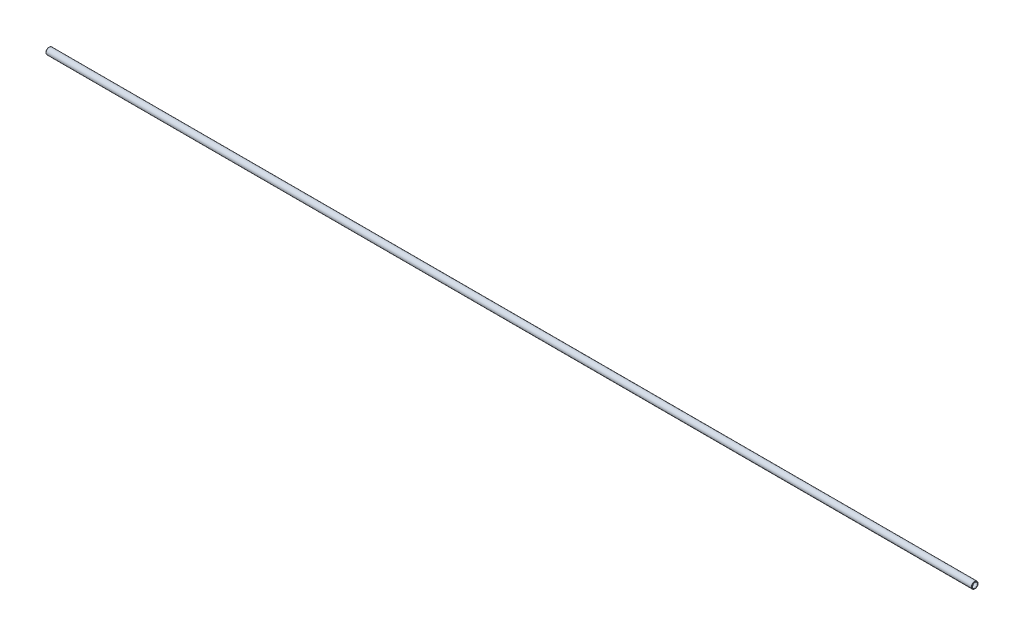
ISO-10303-21;
HEADER;
FILE_DESCRIPTION(('STEP AP214'),'2;1');
FILE_NAME('part.step','',(''),(''),'','','');
FILE_SCHEMA(('AUTOMOTIVE_DESIGN { 1 0 10303 214 1 1 1 1 }'));
ENDSEC;
DATA;
#1=APPLICATION_CONTEXT('core data for automotive mechanical design processes');
#2=APPLICATION_PROTOCOL_DEFINITION('international standard','automotive_design',2000,#1);
#3=PRODUCT_CONTEXT('',#1,'mechanical');
#4=PRODUCT('Part','Part','',(#3));
#5=PRODUCT_RELATED_PRODUCT_CATEGORY('part','',(#4));
#6=PRODUCT_DEFINITION_FORMATION('','',#4);
#7=PRODUCT_DEFINITION_CONTEXT('part definition',#1,'design');
#8=PRODUCT_DEFINITION('design','',#6,#7);
#9=PRODUCT_DEFINITION_SHAPE('','',#8);
#10=(LENGTH_UNIT() NAMED_UNIT(*) SI_UNIT(.MILLI.,.METRE.));
#11=(NAMED_UNIT(*) PLANE_ANGLE_UNIT() SI_UNIT($,.RADIAN.));
#12=(NAMED_UNIT(*) SI_UNIT($,.STERADIAN.) SOLID_ANGLE_UNIT());
#13=UNCERTAINTY_MEASURE_WITH_UNIT(LENGTH_MEASURE(1.E-05),#10,'distance_accuracy_value','');
#14=(GEOMETRIC_REPRESENTATION_CONTEXT(3) GLOBAL_UNCERTAINTY_ASSIGNED_CONTEXT((#13)) GLOBAL_UNIT_ASSIGNED_CONTEXT((#10,
#11,#12)) REPRESENTATION_CONTEXT('',''));
#15=CARTESIAN_POINT('',(0.,0.,0.));
#16=DIRECTION('',(0.,0.,1.));
#17=DIRECTION('',(1.,0.,0.));
#18=AXIS2_PLACEMENT_3D('',#15,#16,#17);
#19=CARTESIAN_POINT('',(-0.355226146905763,0.,0.));
#20=DIRECTION('',(-1.,0.,0.));
#21=DIRECTION('',(0.,0.,1.));
#22=AXIS2_PLACEMENT_3D('',#19,#20,#21);
#23=TOROIDAL_SURFACE('',#22,3.77968126932705,0.126999999999896);
#24=CARTESIAN_POINT('',(-0.445028708116357,0.,0.));
#25=DIRECTION('',(-1.,0.,0.));
#26=DIRECTION('',(0.,0.,1.));
#27=AXIS2_PLACEMENT_3D('',#24,#25,#26);
#28=CIRCLE('',#27,3.6898787081164);
#29=CARTESIAN_POINT('',(-0.445028708116357,0.,3.6898787081164));
#30=VERTEX_POINT('',#29);
#31=EDGE_CURVE('E10',#30,#30,#28,.T.);
#32=ORIENTED_EDGE('',*,*,#31,.F.);
#33=EDGE_LOOP('',(#32));
#34=FACE_BOUND('',#33,.T.);
#35=CARTESIAN_POINT('',(-0.445028708116357,0.,0.));
#36=DIRECTION('',(-1.,0.,0.));
#37=DIRECTION('',(0.,0.,1.));
#38=AXIS2_PLACEMENT_3D('',#35,#36,#37);
#39=CIRCLE('',#38,3.8694838305377);
#40=CARTESIAN_POINT('',(-0.445028708116357,0.,3.8694838305377));
#41=VERTEX_POINT('',#40);
#42=EDGE_CURVE('E78',#41,#41,#39,.T.);
#43=ORIENTED_EDGE('',*,*,#42,.T.);
#44=EDGE_LOOP('',(#43));
#45=FACE_BOUND('',#44,.T.);
#46=ADVANCED_FACE('F32',(#34,#45),#23,.T.);
#47=CARTESIAN_POINT('',(-0.445028708116357,0.,0.));
#48=DIRECTION('',(-1.,0.,0.));
#49=DIRECTION('',(0.,0.,1.));
#50=AXIS2_PLACEMENT_3D('',#47,#48,#49);
#51=CONICAL_SURFACE('',#50,3.6898787081164,0.785398163397365);
#52=CARTESIAN_POINT('',(-0.27939999999993,0.,0.));
#53=DIRECTION('',(-1.,0.,0.));
#54=DIRECTION('',(0.,0.,1.));
#55=AXIS2_PLACEMENT_3D('',#52,#53,#54);
#56=CIRCLE('',#55,3.52425);
#57=CARTESIAN_POINT('',(-0.27939999999993,0.,3.52425));
#58=VERTEX_POINT('',#57);
#59=EDGE_CURVE('E38',#58,#58,#56,.T.);
#60=ORIENTED_EDGE('',*,*,#59,.F.);
#61=EDGE_LOOP('',(#60));
#62=FACE_BOUND('',#61,.T.);
#63=ORIENTED_EDGE('',*,*,#31,.T.);
#64=EDGE_LOOP('',(#63));
#65=FACE_BOUND('',#64,.T.);
#66=ADVANCED_FACE('F151',(#62,#65),#51,.F.);
#67=CARTESIAN_POINT('',(1288.7706,0.,0.));
#68=DIRECTION('',(-1.,0.,0.));
#69=DIRECTION('',(0.,0.,1.));
#70=AXIS2_PLACEMENT_3D('',#67,#68,#69);
#71=CYLINDRICAL_SURFACE('',#70,3.52425);
#72=CARTESIAN_POINT('',(0.,0.,0.));
#73=DIRECTION('',(-1.,0.,0.));
#74=DIRECTION('',(0.,0.,1.));
#75=AXIS2_PLACEMENT_3D('',#72,#73,#74);
#76=CIRCLE('',#75,3.52425);
#77=CARTESIAN_POINT('',(0.,0.,3.52425));
#78=VERTEX_POINT('',#77);
#79=EDGE_CURVE('E42',#78,#78,#76,.T.);
#80=ORIENTED_EDGE('',*,*,#79,.F.);
#81=EDGE_LOOP('',(#80));
#82=FACE_BOUND('',#81,.T.);
#83=ORIENTED_EDGE('',*,*,#59,.T.);
#84=EDGE_LOOP('',(#83));
#85=FACE_BOUND('',#84,.T.);
#86=ADVANCED_FACE('F146',(#82,#85),#71,.F.);
#87=CARTESIAN_POINT('',(0.,0.,0.));
#88=DIRECTION('',(1.,0.,0.));
#89=DIRECTION('',(0.,0.,-1.));
#90=AXIS2_PLACEMENT_3D('',#87,#88,#89);
#91=CONICAL_SURFACE('',#90,3.52425,0.785398163397376);
#92=CARTESIAN_POINT('',(0.558800000000081,0.,0.));
#93=DIRECTION('',(-1.,0.,0.));
#94=DIRECTION('',(0.,0.,1.));
#95=AXIS2_PLACEMENT_3D('',#92,#93,#94);
#96=CIRCLE('',#95,4.08305);
#97=CARTESIAN_POINT('',(0.558800000000081,0.,4.08305));
#98=VERTEX_POINT('',#97);
#99=EDGE_CURVE('E46',#98,#98,#96,.T.);
#100=ORIENTED_EDGE('',*,*,#99,.F.);
#101=EDGE_LOOP('',(#100));
#102=FACE_BOUND('',#101,.T.);
#103=ORIENTED_EDGE('',*,*,#79,.T.);
#104=EDGE_LOOP('',(#103));
#105=FACE_BOUND('',#104,.T.);
#106=ADVANCED_FACE('F140',(#102,#105),#91,.F.);
#107=CARTESIAN_POINT('',(1288.7706,0.,0.));
#108=DIRECTION('',(-1.,0.,0.));
#109=DIRECTION('',(0.,0.,1.));
#110=AXIS2_PLACEMENT_3D('',#107,#108,#109);
#111=CYLINDRICAL_SURFACE('',#110,4.08305);
#112=CARTESIAN_POINT('',(1288.2118,0.,0.));
#113=DIRECTION('',(-1.,0.,0.));
#114=DIRECTION('',(0.,0.,1.));
#115=AXIS2_PLACEMENT_3D('',#112,#113,#114);
#116=CIRCLE('',#115,4.08305);
#117=CARTESIAN_POINT('',(1288.2118,0.,4.08305));
#118=VERTEX_POINT('',#117);
#119=EDGE_CURVE('E51',#118,#118,#116,.T.);
#120=ORIENTED_EDGE('',*,*,#119,.F.);
#121=EDGE_LOOP('',(#120));
#122=FACE_BOUND('',#121,.T.);
#123=ORIENTED_EDGE('',*,*,#99,.T.);
#124=EDGE_LOOP('',(#123));
#125=FACE_BOUND('',#124,.T.);
#126=ADVANCED_FACE('F134',(#122,#125),#111,.F.);
#127=CARTESIAN_POINT('',(1288.2118,0.,0.));
#128=DIRECTION('',(-1.,0.,0.));
#129=DIRECTION('',(0.,0.,1.));
#130=AXIS2_PLACEMENT_3D('',#127,#128,#129);
#131=CONICAL_SURFACE('',#130,4.08305,0.785398163397376);
#132=CARTESIAN_POINT('',(1288.7706,0.,0.));
#133=DIRECTION('',(-1.,0.,0.));
#134=DIRECTION('',(0.,0.,1.));
#135=AXIS2_PLACEMENT_3D('',#132,#133,#134);
#136=CIRCLE('',#135,3.52425);
#137=CARTESIAN_POINT('',(1288.7706,0.,3.52425));
#138=VERTEX_POINT('',#137);
#139=EDGE_CURVE('E54',#138,#138,#136,.T.);
#140=ORIENTED_EDGE('',*,*,#139,.F.);
#141=EDGE_LOOP('',(#140));
#142=FACE_BOUND('',#141,.T.);
#143=ORIENTED_EDGE('',*,*,#119,.T.);
#144=EDGE_LOOP('',(#143));
#145=FACE_BOUND('',#144,.T.);
#146=ADVANCED_FACE('F128',(#142,#145),#131,.F.);
#147=CARTESIAN_POINT('',(1288.7706,0.,0.));
#148=DIRECTION('',(-1.,0.,0.));
#149=DIRECTION('',(0.,0.,1.));
#150=AXIS2_PLACEMENT_3D('',#147,#148,#149);
#151=CYLINDRICAL_SURFACE('',#150,3.52425);
#152=CARTESIAN_POINT('',(1289.05,0.,0.));
#153=DIRECTION('',(-1.,0.,0.));
#154=DIRECTION('',(0.,0.,1.));
#155=AXIS2_PLACEMENT_3D('',#152,#153,#154);
#156=CIRCLE('',#155,3.52425);
#157=CARTESIAN_POINT('',(1289.05,0.,3.52425));
#158=VERTEX_POINT('',#157);
#159=EDGE_CURVE('E57',#158,#158,#156,.T.);
#160=ORIENTED_EDGE('',*,*,#159,.F.);
#161=EDGE_LOOP('',(#160));
#162=FACE_BOUND('',#161,.T.);
#163=ORIENTED_EDGE('',*,*,#139,.T.);
#164=EDGE_LOOP('',(#163));
#165=FACE_BOUND('',#164,.T.);
#166=ADVANCED_FACE('F122',(#162,#165),#151,.F.);
#167=CARTESIAN_POINT('',(1289.05,0.,0.));
#168=DIRECTION('',(1.,0.,0.));
#169=DIRECTION('',(0.,0.,-1.));
#170=AXIS2_PLACEMENT_3D('',#167,#168,#169);
#171=CONICAL_SURFACE('',#170,3.52425,0.785398163438399);
#172=CARTESIAN_POINT('',(1289.21562870811,0.,0.));
#173=DIRECTION('',(-1.,0.,0.));
#174=DIRECTION('',(0.,0.,1.));
#175=AXIS2_PLACEMENT_3D('',#172,#173,#174);
#176=CIRCLE('',#175,3.68987870812777);
#177=CARTESIAN_POINT('',(1289.21562870811,0.,3.68987870812777));
#178=VERTEX_POINT('',#177);
#179=EDGE_CURVE('E60',#178,#178,#176,.T.);
#180=ORIENTED_EDGE('',*,*,#179,.F.);
#181=EDGE_LOOP('',(#180));
#182=FACE_BOUND('',#181,.T.);
#183=ORIENTED_EDGE('',*,*,#159,.T.);
#184=EDGE_LOOP('',(#183));
#185=FACE_BOUND('',#184,.T.);
#186=ADVANCED_FACE('F116',(#182,#185),#171,.F.);
#187=CARTESIAN_POINT('',(1289.12582614693,0.,0.));
#188=DIRECTION('',(-1.,0.,0.));
#189=DIRECTION('',(0.,0.,1.));
#190=AXIS2_PLACEMENT_3D('',#187,#188,#189);
#191=TOROIDAL_SURFACE('',#190,3.77968126932705,0.126999999976453);
#192=CARTESIAN_POINT('',(1289.21562870812,0.,0.));
#193=DIRECTION('',(-1.,0.,0.));
#194=DIRECTION('',(0.,0.,1.));
#195=AXIS2_PLACEMENT_3D('',#192,#193,#194);
#196=CIRCLE('',#195,3.86948383050614);
#197=CARTESIAN_POINT('',(1289.21562870812,0.,3.86948383050614));
#198=VERTEX_POINT('',#197);
#199=EDGE_CURVE('E63',#198,#198,#196,.T.);
#200=ORIENTED_EDGE('',*,*,#199,.F.);
#201=EDGE_LOOP('',(#200));
#202=FACE_BOUND('',#201,.T.);
#203=ORIENTED_EDGE('',*,*,#179,.T.);
#204=EDGE_LOOP('',(#203));
#205=FACE_BOUND('',#204,.T.);
#206=ADVANCED_FACE('F110',(#202,#205),#191,.T.);
#207=CARTESIAN_POINT('',(1289.21562870812,0.,0.));
#208=DIRECTION('',(-1.,0.,0.));
#209=DIRECTION('',(0.,0.,1.));
#210=AXIS2_PLACEMENT_3D('',#207,#208,#209);
#211=CONICAL_SURFACE('',#210,3.86948383050614,0.785398163397445);
#212=CARTESIAN_POINT('',(1288.68948126927,0.,0.));
#213=DIRECTION('',(-1.,0.,0.));
#214=DIRECTION('',(0.,0.,1.));
#215=AXIS2_PLACEMENT_3D('',#212,#213,#214);
#216=CIRCLE('',#215,4.39563126935618);
#217=CARTESIAN_POINT('',(1288.68948126927,0.,4.39563126935618));
#218=VERTEX_POINT('',#217);
#219=EDGE_CURVE('E66',#218,#218,#216,.T.);
#220=ORIENTED_EDGE('',*,*,#219,.F.);
#221=EDGE_LOOP('',(#220));
#222=FACE_BOUND('',#221,.T.);
#223=ORIENTED_EDGE('',*,*,#199,.T.);
#224=EDGE_LOOP('',(#223));
#225=FACE_BOUND('',#224,.T.);
#226=ADVANCED_FACE('F104',(#222,#225),#211,.T.);
#227=CARTESIAN_POINT('',(1288.29435000001,0.,0.));
#228=DIRECTION('',(-1.,0.,0.));
#229=DIRECTION('',(0.,0.,1.));
#230=AXIS2_PLACEMENT_3D('',#227,#228,#229);
#231=TOROIDAL_SURFACE('',#230,4.0005000000993,0.5587999999008);
#232=CARTESIAN_POINT('',(1288.29435,0.,0.));
#233=DIRECTION('',(-1.,0.,0.));
#234=DIRECTION('',(0.,0.,1.));
#235=AXIS2_PLACEMENT_3D('',#232,#233,#234);
#236=CIRCLE('',#235,4.5593);
#237=CARTESIAN_POINT('',(1288.29435,0.,4.5593));
#238=VERTEX_POINT('',#237);
#239=EDGE_CURVE('E69',#238,#238,#236,.T.);
#240=ORIENTED_EDGE('',*,*,#239,.F.);
#241=EDGE_LOOP('',(#240));
#242=FACE_BOUND('',#241,.T.);
#243=ORIENTED_EDGE('',*,*,#219,.T.);
#244=EDGE_LOOP('',(#243));
#245=FACE_BOUND('',#244,.T.);
#246=ADVANCED_FACE('F98',(#242,#245),#231,.T.);
#247=CARTESIAN_POINT('',(1288.7706,0.,0.));
#248=DIRECTION('',(-1.,0.,0.));
#249=DIRECTION('',(0.,0.,1.));
#250=AXIS2_PLACEMENT_3D('',#247,#248,#249);
#251=CYLINDRICAL_SURFACE('',#250,4.5593);
#252=CARTESIAN_POINT('',(0.476249999999956,0.,0.));
#253=DIRECTION('',(-1.,0.,0.));
#254=DIRECTION('',(0.,0.,1.));
#255=AXIS2_PLACEMENT_3D('',#252,#253,#254);
#256=CIRCLE('',#255,4.5593);
#257=CARTESIAN_POINT('',(0.476249999999956,0.,4.5593));
#258=VERTEX_POINT('',#257);
#259=EDGE_CURVE('E72',#258,#258,#256,.T.);
#260=ORIENTED_EDGE('',*,*,#259,.F.);
#261=EDGE_LOOP('',(#260));
#262=FACE_BOUND('',#261,.T.);
#263=ORIENTED_EDGE('',*,*,#239,.T.);
#264=EDGE_LOOP('',(#263));
#265=FACE_BOUND('',#264,.T.);
#266=ADVANCED_FACE('F92',(#262,#265),#251,.T.);
#267=CARTESIAN_POINT('',(0.476249999999922,0.,0.));
#268=DIRECTION('',(-1.,0.,0.));
#269=DIRECTION('',(0.,0.,1.));
#270=AXIS2_PLACEMENT_3D('',#267,#268,#269);
#271=TOROIDAL_SURFACE('',#270,4.00050000000029,0.558799999999707);
#272=CARTESIAN_POINT('',(0.0811187306728467,0.,0.));
#273=DIRECTION('',(-1.,0.,0.));
#274=DIRECTION('',(0.,0.,1.));
#275=AXIS2_PLACEMENT_3D('',#272,#273,#274);
#276=CIRCLE('',#275,4.395631269327);
#277=CARTESIAN_POINT('',(0.0811187306728467,0.,4.395631269327));
#278=VERTEX_POINT('',#277);
#279=EDGE_CURVE('E75',#278,#278,#276,.T.);
#280=ORIENTED_EDGE('',*,*,#279,.F.);
#281=EDGE_LOOP('',(#280));
#282=FACE_BOUND('',#281,.T.);
#283=ORIENTED_EDGE('',*,*,#259,.T.);
#284=EDGE_LOOP('',(#283));
#285=FACE_BOUND('',#284,.T.);
#286=ADVANCED_FACE('F86',(#282,#285),#271,.T.);
#287=CARTESIAN_POINT('',(0.0811187306728467,0.,0.));
#288=DIRECTION('',(1.,0.,0.));
#289=DIRECTION('',(0.,0.,-1.));
#290=AXIS2_PLACEMENT_3D('',#287,#288,#289);
#291=CONICAL_SURFACE('',#290,4.395631269327,0.785398163397539);
#292=ORIENTED_EDGE('',*,*,#42,.F.);
#293=EDGE_LOOP('',(#292));
#294=FACE_BOUND('',#293,.T.);
#295=ORIENTED_EDGE('',*,*,#279,.T.);
#296=EDGE_LOOP('',(#295));
#297=FACE_BOUND('',#296,.T.);
#298=ADVANCED_FACE('F83',(#294,#297),#291,.T.);
#299=CLOSED_SHELL('',(#46,#66,#86,#106,#126,#146,#166,#186,#206,#226,#246,#266,#286,#298));
#300=MANIFOLD_SOLID_BREP('B2',#299);
#301=ADVANCED_BREP_SHAPE_REPRESENTATION('',(#18,#300),#14);
#302=SHAPE_DEFINITION_REPRESENTATION(#9,#301);
ENDSEC;
END-ISO-10303-21;
